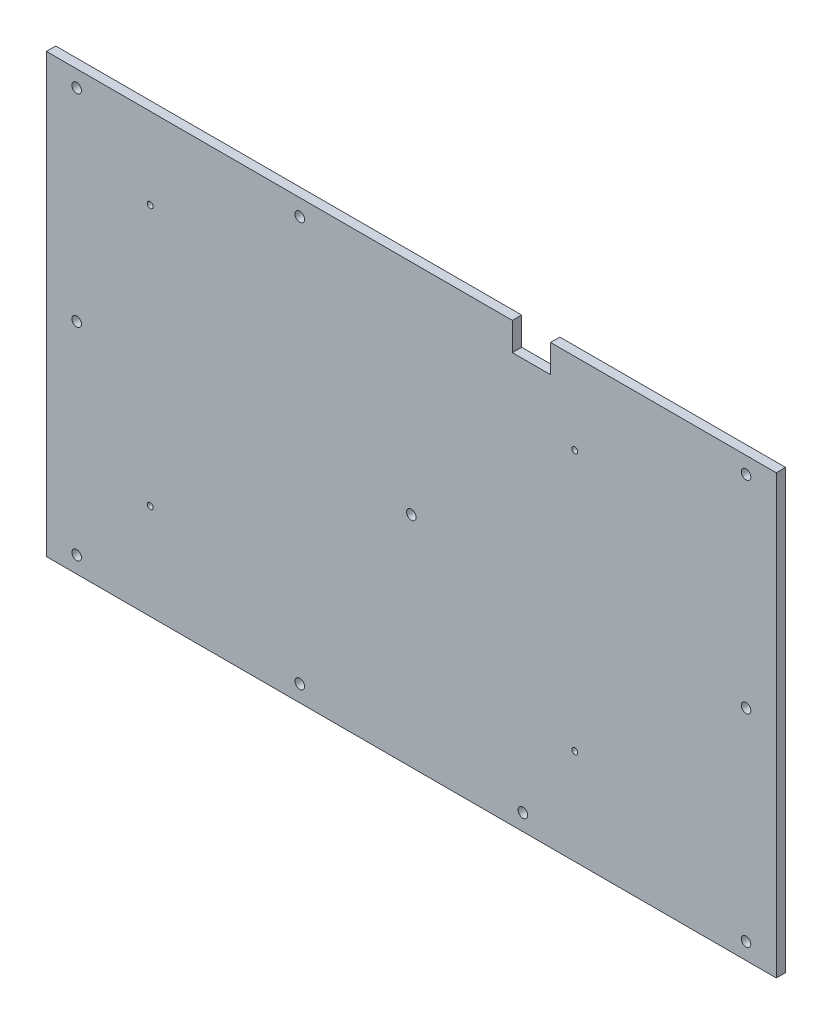
ISO-10303-21;
HEADER;
FILE_DESCRIPTION(('STEP AP214'),'2;1');
FILE_NAME('part.step','',(''),(''),'','','');
FILE_SCHEMA(('AUTOMOTIVE_DESIGN { 1 0 10303 214 1 1 1 1 }'));
ENDSEC;
DATA;
#1=APPLICATION_CONTEXT('core data for automotive mechanical design processes');
#2=APPLICATION_PROTOCOL_DEFINITION('international standard','automotive_design',2000,#1);
#3=PRODUCT_CONTEXT('',#1,'mechanical');
#4=PRODUCT('Part','Part','',(#3));
#5=PRODUCT_RELATED_PRODUCT_CATEGORY('part','',(#4));
#6=PRODUCT_DEFINITION_FORMATION('','',#4);
#7=PRODUCT_DEFINITION_CONTEXT('part definition',#1,'design');
#8=PRODUCT_DEFINITION('design','',#6,#7);
#9=PRODUCT_DEFINITION_SHAPE('','',#8);
#10=(LENGTH_UNIT() NAMED_UNIT(*) SI_UNIT(.MILLI.,.METRE.));
#11=(NAMED_UNIT(*) PLANE_ANGLE_UNIT() SI_UNIT($,.RADIAN.));
#12=(NAMED_UNIT(*) SI_UNIT($,.STERADIAN.) SOLID_ANGLE_UNIT());
#13=UNCERTAINTY_MEASURE_WITH_UNIT(LENGTH_MEASURE(1.E-05),#10,'distance_accuracy_value','');
#14=(GEOMETRIC_REPRESENTATION_CONTEXT(3) GLOBAL_UNCERTAINTY_ASSIGNED_CONTEXT((#13)) GLOBAL_UNIT_ASSIGNED_CONTEXT((#10,
#11,#12)) REPRESENTATION_CONTEXT('',''));
#15=CARTESIAN_POINT('',(0.,0.,0.));
#16=DIRECTION('',(0.,0.,1.));
#17=DIRECTION('',(1.,0.,0.));
#18=AXIS2_PLACEMENT_3D('',#15,#16,#17);
#19=CARTESIAN_POINT('',(0.,0.,0.));
#20=DIRECTION('',(0.,0.,1.));
#21=DIRECTION('',(1.,0.,0.));
#22=AXIS2_PLACEMENT_3D('',#19,#20,#21);
#23=PLANE('',#22);
#24=CARTESIAN_POINT('',(55.7276,-41.9735,0.));
#25=DIRECTION('',(0.,0.,-1.));
#26=DIRECTION('',(-1.,0.,0.));
#27=AXIS2_PLACEMENT_3D('',#24,#25,#26);
#28=CIRCLE('',#27,1.016);
#29=CARTESIAN_POINT('',(54.7116,-41.9735,0.));
#30=VERTEX_POINT('',#29);
#31=EDGE_CURVE('E258',#30,#30,#28,.T.);
#32=ORIENTED_EDGE('',*,*,#31,.F.);
#33=EDGE_LOOP('',(#32));
#34=FACE_BOUND('',#33,.T.);
#35=CARTESIAN_POINT('',(55.7276,46.9265,0.));
#36=DIRECTION('',(0.,0.,-1.));
#37=DIRECTION('',(-1.,0.,0.));
#38=AXIS2_PLACEMENT_3D('',#35,#36,#37);
#39=CIRCLE('',#38,1.016);
#40=CARTESIAN_POINT('',(54.7116,46.9265,0.));
#41=VERTEX_POINT('',#40);
#42=EDGE_CURVE('E252',#41,#41,#39,.T.);
#43=ORIENTED_EDGE('',*,*,#42,.F.);
#44=EDGE_LOOP('',(#43));
#45=FACE_BOUND('',#44,.T.);
#46=CARTESIAN_POINT('',(-89.0524,46.9265,0.));
#47=DIRECTION('',(0.,0.,-1.));
#48=DIRECTION('',(-1.,0.,0.));
#49=AXIS2_PLACEMENT_3D('',#46,#47,#48);
#50=CIRCLE('',#49,1.016);
#51=CARTESIAN_POINT('',(-90.0684,46.9265,0.));
#52=VERTEX_POINT('',#51);
#53=EDGE_CURVE('E246',#52,#52,#50,.T.);
#54=ORIENTED_EDGE('',*,*,#53,.F.);
#55=EDGE_LOOP('',(#54));
#56=FACE_BOUND('',#55,.T.);
#57=CARTESIAN_POINT('',(-89.0524,-41.9735,0.));
#58=DIRECTION('',(0.,0.,-1.));
#59=DIRECTION('',(-1.,0.,0.));
#60=AXIS2_PLACEMENT_3D('',#57,#58,#59);
#61=CIRCLE('',#60,1.016);
#62=CARTESIAN_POINT('',(-90.0684,-41.9735,0.));
#63=VERTEX_POINT('',#62);
#64=EDGE_CURVE('E240',#63,#63,#61,.T.);
#65=ORIENTED_EDGE('',*,*,#64,.F.);
#66=EDGE_LOOP('',(#65));
#67=FACE_BOUND('',#66,.T.);
#68=CARTESIAN_POINT('',(-114.1476,-68.9864,0.));
#69=DIRECTION('',(0.,0.,-1.));
#70=DIRECTION('',(-1.,0.,0.));
#71=AXIS2_PLACEMENT_3D('',#68,#69,#70);
#72=CIRCLE('',#71,1.63194999999999);
#73=CARTESIAN_POINT('',(-115.77955,-68.9864,0.));
#74=VERTEX_POINT('',#73);
#75=EDGE_CURVE('E234',#74,#74,#72,.T.);
#76=ORIENTED_EDGE('',*,*,#75,.F.);
#77=EDGE_LOOP('',(#76));
#78=FACE_BOUND('',#77,.T.);
#79=CARTESIAN_POINT('',(114.1476,-68.9864,0.));
#80=DIRECTION('',(0.,0.,-1.));
#81=DIRECTION('',(-1.,0.,0.));
#82=AXIS2_PLACEMENT_3D('',#79,#80,#81);
#83=CIRCLE('',#82,1.63194999999999);
#84=CARTESIAN_POINT('',(112.51565,-68.9864,0.));
#85=VERTEX_POINT('',#84);
#86=EDGE_CURVE('E228',#85,#85,#83,.T.);
#87=ORIENTED_EDGE('',*,*,#86,.F.);
#88=EDGE_LOOP('',(#87));
#89=FACE_BOUND('',#88,.T.);
#90=CARTESIAN_POINT('',(114.1476,68.9864,0.));
#91=DIRECTION('',(0.,0.,-1.));
#92=DIRECTION('',(-1.,0.,0.));
#93=AXIS2_PLACEMENT_3D('',#90,#91,#92);
#94=CIRCLE('',#93,1.63194999999999);
#95=CARTESIAN_POINT('',(112.51565,68.9864,0.));
#96=VERTEX_POINT('',#95);
#97=EDGE_CURVE('E225',#96,#96,#94,.T.);
#98=ORIENTED_EDGE('',*,*,#97,.F.);
#99=EDGE_LOOP('',(#98));
#100=FACE_BOUND('',#99,.T.);
#101=CARTESIAN_POINT('',(-114.1476,68.9864,0.));
#102=DIRECTION('',(0.,0.,-1.));
#103=DIRECTION('',(-1.,0.,0.));
#104=AXIS2_PLACEMENT_3D('',#101,#102,#103);
#105=CIRCLE('',#104,1.63194999999999);
#106=CARTESIAN_POINT('',(-115.77955,68.9864,0.));
#107=VERTEX_POINT('',#106);
#108=EDGE_CURVE('E219',#107,#107,#105,.T.);
#109=ORIENTED_EDGE('',*,*,#108,.F.);
#110=EDGE_LOOP('',(#109));
#111=FACE_BOUND('',#110,.T.);
#112=CARTESIAN_POINT('',(-114.1476,0.,0.));
#113=DIRECTION('',(0.,0.,-1.));
#114=DIRECTION('',(-1.,0.,0.));
#115=AXIS2_PLACEMENT_3D('',#112,#113,#114);
#116=CIRCLE('',#115,1.63194999999999);
#117=CARTESIAN_POINT('',(-115.77955,0.,0.));
#118=VERTEX_POINT('',#117);
#119=EDGE_CURVE('E213',#118,#118,#116,.T.);
#120=ORIENTED_EDGE('',*,*,#119,.F.);
#121=EDGE_LOOP('',(#120));
#122=FACE_BOUND('',#121,.T.);
#123=CARTESIAN_POINT('',(114.1476,0.,0.));
#124=DIRECTION('',(0.,0.,-1.));
#125=DIRECTION('',(-1.,0.,0.));
#126=AXIS2_PLACEMENT_3D('',#123,#124,#125);
#127=CIRCLE('',#126,1.63194999999999);
#128=CARTESIAN_POINT('',(112.51565,0.,0.));
#129=VERTEX_POINT('',#128);
#130=EDGE_CURVE('E207',#129,#129,#127,.T.);
#131=ORIENTED_EDGE('',*,*,#130,.F.);
#132=EDGE_LOOP('',(#131));
#133=FACE_BOUND('',#132,.T.);
#134=CARTESIAN_POINT('',(38.0492,-68.9864,0.));
#135=DIRECTION('',(0.,0.,-1.));
#136=DIRECTION('',(-1.,0.,0.));
#137=AXIS2_PLACEMENT_3D('',#134,#135,#136);
#138=CIRCLE('',#137,1.63194999999999);
#139=CARTESIAN_POINT('',(36.41725,-68.9864,0.));
#140=VERTEX_POINT('',#139);
#141=EDGE_CURVE('E195',#140,#140,#138,.T.);
#142=ORIENTED_EDGE('',*,*,#141,.F.);
#143=EDGE_LOOP('',(#142));
#144=FACE_BOUND('',#143,.T.);
#145=CARTESIAN_POINT('',(-38.0492,-68.9864,0.));
#146=DIRECTION('',(0.,0.,-1.));
#147=DIRECTION('',(-1.,0.,0.));
#148=AXIS2_PLACEMENT_3D('',#145,#146,#147);
#149=CIRCLE('',#148,1.63194999999999);
#150=CARTESIAN_POINT('',(-39.68115,-68.9864,0.));
#151=VERTEX_POINT('',#150);
#152=EDGE_CURVE('E189',#151,#151,#149,.T.);
#153=ORIENTED_EDGE('',*,*,#152,.F.);
#154=EDGE_LOOP('',(#153));
#155=FACE_BOUND('',#154,.T.);
#156=CARTESIAN_POINT('',(0.,0.,0.));
#157=DIRECTION('',(0.,0.,-1.));
#158=DIRECTION('',(-1.,0.,0.));
#159=AXIS2_PLACEMENT_3D('',#156,#157,#158);
#160=CIRCLE('',#159,1.63194999999999);
#161=CARTESIAN_POINT('',(-1.63194999999999,0.,0.));
#162=VERTEX_POINT('',#161);
#163=EDGE_CURVE('E183',#162,#162,#160,.T.);
#164=ORIENTED_EDGE('',*,*,#163,.F.);
#165=EDGE_LOOP('',(#164));
#166=FACE_BOUND('',#165,.T.);
#167=DIRECTION('',(0.,1.,0.));
#168=VECTOR('',#167,1.);
#169=CARTESIAN_POINT('',(47.4726000000003,0.,0.));
#170=LINE('',#169,#168);
#171=CARTESIAN_POINT('',(47.4726000000003,65.0875000000002,0.));
#172=VERTEX_POINT('',#171);
#173=CARTESIAN_POINT('',(47.4726000000003,74.6125000000002,0.));
#174=VERTEX_POINT('',#173);
#175=EDGE_CURVE('E132',#172,#174,#170,.T.);
#176=ORIENTED_EDGE('',*,*,#175,.T.);
#177=DIRECTION('',(1.,0.,0.));
#178=VECTOR('',#177,1.);
#179=CARTESIAN_POINT('',(0.,74.6125000000002,0.));
#180=LINE('',#179,#178);
#181=CARTESIAN_POINT('',(124.46,74.6125000000002,0.));
#182=VERTEX_POINT('',#181);
#183=EDGE_CURVE('E145',#174,#182,#180,.T.);
#184=ORIENTED_EDGE('',*,*,#183,.T.);
#185=DIRECTION('',(0.,-1.,0.));
#186=VECTOR('',#185,1.);
#187=CARTESIAN_POINT('',(124.46,1.11022302462516E-13,0.));
#188=LINE('',#187,#186);
#189=CARTESIAN_POINT('',(124.46,-74.6125,0.));
#190=VERTEX_POINT('',#189);
#191=EDGE_CURVE('E148',#182,#190,#188,.T.);
#192=ORIENTED_EDGE('',*,*,#191,.T.);
#193=DIRECTION('',(1.,0.,0.));
#194=VECTOR('',#193,1.);
#195=CARTESIAN_POINT('',(0.,-74.6125000000001,0.));
#196=LINE('',#195,#194);
#197=CARTESIAN_POINT('',(-124.46,-74.6125000000001,0.));
#198=VERTEX_POINT('',#197);
#199=EDGE_CURVE('E120',#198,#190,#196,.T.);
#200=ORIENTED_EDGE('',*,*,#199,.F.);
#201=DIRECTION('',(0.,-1.,0.));
#202=VECTOR('',#201,1.);
#203=CARTESIAN_POINT('',(-124.46,0.,0.));
#204=LINE('',#203,#202);
#205=CARTESIAN_POINT('',(-124.46,74.6125000000001,0.));
#206=VERTEX_POINT('',#205);
#207=EDGE_CURVE('E144',#206,#198,#204,.T.);
#208=ORIENTED_EDGE('',*,*,#207,.F.);
#209=CARTESIAN_POINT('',(34.4424000000002,74.6125000000002,0.));
#210=VERTEX_POINT('',#209);
#211=EDGE_CURVE('E141',#206,#210,#180,.T.);
#212=ORIENTED_EDGE('',*,*,#211,.T.);
#213=DIRECTION('',(0.,-1.,0.));
#214=VECTOR('',#213,1.);
#215=CARTESIAN_POINT('',(34.4424000000003,0.,0.));
#216=LINE('',#215,#214);
#217=CARTESIAN_POINT('',(34.4424000000002,65.0875000000002,0.));
#218=VERTEX_POINT('',#217);
#219=EDGE_CURVE('E138',#210,#218,#216,.T.);
#220=ORIENTED_EDGE('',*,*,#219,.T.);
#221=DIRECTION('',(1.,0.,0.));
#222=VECTOR('',#221,1.);
#223=CARTESIAN_POINT('',(0.,65.0875000000002,0.));
#224=LINE('',#223,#222);
#225=EDGE_CURVE('E134',#218,#172,#224,.T.);
#226=ORIENTED_EDGE('',*,*,#225,.T.);
#227=EDGE_LOOP('',(#176,#184,#192,#200,#208,#212,#220,#226));
#228=FACE_BOUND('',#227,.T.);
#229=CARTESIAN_POINT('',(-38.0492,68.9864,0.));
#230=DIRECTION('',(0.,0.,-1.));
#231=DIRECTION('',(-1.,0.,0.));
#232=AXIS2_PLACEMENT_3D('',#229,#230,#231);
#233=CIRCLE('',#232,1.63194999999999);
#234=CARTESIAN_POINT('',(-39.68115,68.9864,0.));
#235=VERTEX_POINT('',#234);
#236=EDGE_CURVE('E201',#235,#235,#233,.T.);
#237=ORIENTED_EDGE('',*,*,#236,.F.);
#238=EDGE_LOOP('',(#237));
#239=FACE_BOUND('',#238,.T.);
#240=ADVANCED_FACE('F35',(#34,#45,#56,#67,#78,#89,#100,#111,#122,#133,#144,#155,#166,#228,#239),
#23,.F.);
#241=CARTESIAN_POINT('',(47.4726000000003,0.,3.175));
#242=DIRECTION('',(-1.,0.,0.));
#243=DIRECTION('',(0.,-1.,0.));
#244=AXIS2_PLACEMENT_3D('',#241,#242,#243);
#245=PLANE('',#244);
#246=ORIENTED_EDGE('',*,*,#175,.F.);
#247=DIRECTION('',(0.,0.,-1.));
#248=VECTOR('',#247,1.);
#249=CARTESIAN_POINT('',(47.4726000000003,65.0875000000002,3.175));
#250=LINE('',#249,#248);
#251=CARTESIAN_POINT('',(47.4726000000003,65.0875000000002,3.175));
#252=VERTEX_POINT('',#251);
#253=EDGE_CURVE('E11',#252,#172,#250,.T.);
#254=ORIENTED_EDGE('',*,*,#253,.F.);
#255=DIRECTION('',(0.,1.,0.));
#256=VECTOR('',#255,1.);
#257=CARTESIAN_POINT('',(47.4726000000003,0.,3.175));
#258=LINE('',#257,#256);
#259=CARTESIAN_POINT('',(47.4726000000003,74.6125000000002,3.175));
#260=VERTEX_POINT('',#259);
#261=EDGE_CURVE('E177',#252,#260,#258,.T.);
#262=ORIENTED_EDGE('',*,*,#261,.T.);
#263=DIRECTION('',(0.,0.,-1.));
#264=VECTOR('',#263,1.);
#265=CARTESIAN_POINT('',(47.4726000000003,74.6125000000002,3.175));
#266=LINE('',#265,#264);
#267=EDGE_CURVE('E53',#260,#174,#266,.T.);
#268=ORIENTED_EDGE('',*,*,#267,.T.);
#269=EDGE_LOOP('',(#246,#254,#262,#268));
#270=FACE_BOUND('',#269,.T.);
#271=ADVANCED_FACE('F37',(#270),#245,.T.);
#272=CARTESIAN_POINT('',(0.,65.0875000000002,3.175));
#273=DIRECTION('',(0.,1.,0.));
#274=DIRECTION('',(-1.,0.,0.));
#275=AXIS2_PLACEMENT_3D('',#272,#273,#274);
#276=PLANE('',#275);
#277=ORIENTED_EDGE('',*,*,#225,.F.);
#278=DIRECTION('',(0.,0.,-1.));
#279=VECTOR('',#278,1.);
#280=CARTESIAN_POINT('',(34.4424000000002,65.0875000000002,3.175));
#281=LINE('',#280,#279);
#282=CARTESIAN_POINT('',(34.4424000000002,65.0875000000002,3.175));
#283=VERTEX_POINT('',#282);
#284=EDGE_CURVE('E45',#283,#218,#281,.T.);
#285=ORIENTED_EDGE('',*,*,#284,.F.);
#286=DIRECTION('',(1.,0.,0.));
#287=VECTOR('',#286,1.);
#288=CARTESIAN_POINT('',(0.,65.0875000000002,3.175));
#289=LINE('',#288,#287);
#290=EDGE_CURVE('E175',#283,#252,#289,.T.);
#291=ORIENTED_EDGE('',*,*,#290,.T.);
#292=ORIENTED_EDGE('',*,*,#253,.T.);
#293=EDGE_LOOP('',(#277,#285,#291,#292));
#294=FACE_BOUND('',#293,.T.);
#295=ADVANCED_FACE('F167',(#294),#276,.T.);
#296=CARTESIAN_POINT('',(34.4424000000003,0.,3.175));
#297=DIRECTION('',(1.,0.,0.));
#298=DIRECTION('',(0.,1.,0.));
#299=AXIS2_PLACEMENT_3D('',#296,#297,#298);
#300=PLANE('',#299);
#301=ORIENTED_EDGE('',*,*,#219,.F.);
#302=DIRECTION('',(0.,0.,-1.));
#303=VECTOR('',#302,1.);
#304=CARTESIAN_POINT('',(34.4424000000002,74.6125000000002,3.175));
#305=LINE('',#304,#303);
#306=CARTESIAN_POINT('',(34.4424000000002,74.6125000000002,3.175));
#307=VERTEX_POINT('',#306);
#308=EDGE_CURVE('E155',#307,#210,#305,.T.);
#309=ORIENTED_EDGE('',*,*,#308,.F.);
#310=DIRECTION('',(0.,-1.,0.));
#311=VECTOR('',#310,1.);
#312=CARTESIAN_POINT('',(34.4424000000003,0.,3.175));
#313=LINE('',#312,#311);
#314=EDGE_CURVE('E163',#307,#283,#313,.T.);
#315=ORIENTED_EDGE('',*,*,#314,.T.);
#316=ORIENTED_EDGE('',*,*,#284,.T.);
#317=EDGE_LOOP('',(#301,#309,#315,#316));
#318=FACE_BOUND('',#317,.T.);
#319=ADVANCED_FACE('F161',(#318),#300,.T.);
#320=CARTESIAN_POINT('',(0.,74.6125000000002,3.175));
#321=DIRECTION('',(0.,1.,0.));
#322=DIRECTION('',(-1.,0.,0.));
#323=AXIS2_PLACEMENT_3D('',#320,#321,#322);
#324=PLANE('',#323);
#325=ORIENTED_EDGE('',*,*,#211,.F.);
#326=DIRECTION('',(0.,0.,-1.));
#327=VECTOR('',#326,1.);
#328=CARTESIAN_POINT('',(-124.46,74.6125000000001,3.175));
#329=LINE('',#328,#327);
#330=CARTESIAN_POINT('',(-124.46,74.6125000000001,3.175));
#331=VERTEX_POINT('',#330);
#332=EDGE_CURVE('E153',#331,#206,#329,.T.);
#333=ORIENTED_EDGE('',*,*,#332,.F.);
#334=DIRECTION('',(1.,0.,0.));
#335=VECTOR('',#334,1.);
#336=CARTESIAN_POINT('',(0.,74.6125000000002,3.175));
#337=LINE('',#336,#335);
#338=EDGE_CURVE('E129',#331,#307,#337,.T.);
#339=ORIENTED_EDGE('',*,*,#338,.T.);
#340=ORIENTED_EDGE('',*,*,#308,.T.);
#341=EDGE_LOOP('',(#325,#333,#339,#340));
#342=FACE_BOUND('',#341,.T.);
#343=ADVANCED_FACE('F173',(#342),#324,.T.);
#344=CARTESIAN_POINT('',(-124.46,0.,3.175));
#345=DIRECTION('',(1.,0.,0.));
#346=DIRECTION('',(0.,1.,0.));
#347=AXIS2_PLACEMENT_3D('',#344,#345,#346);
#348=PLANE('',#347);
#349=ORIENTED_EDGE('',*,*,#207,.T.);
#350=DIRECTION('',(0.,0.,-1.));
#351=VECTOR('',#350,1.);
#352=CARTESIAN_POINT('',(-124.46,-74.6125000000001,3.175));
#353=LINE('',#352,#351);
#354=CARTESIAN_POINT('',(-124.46,-74.6125000000001,3.175));
#355=VERTEX_POINT('',#354);
#356=EDGE_CURVE('E123',#355,#198,#353,.T.);
#357=ORIENTED_EDGE('',*,*,#356,.F.);
#358=DIRECTION('',(0.,-1.,0.));
#359=VECTOR('',#358,1.);
#360=CARTESIAN_POINT('',(-124.46,0.,3.175));
#361=LINE('',#360,#359);
#362=EDGE_CURVE('E111',#331,#355,#361,.T.);
#363=ORIENTED_EDGE('',*,*,#362,.F.);
#364=ORIENTED_EDGE('',*,*,#332,.T.);
#365=EDGE_LOOP('',(#349,#357,#363,#364));
#366=FACE_BOUND('',#365,.T.);
#367=ADVANCED_FACE('F314',(#366),#348,.F.);
#368=CARTESIAN_POINT('',(0.,-74.6125000000001,3.175));
#369=DIRECTION('',(0.,1.,0.));
#370=DIRECTION('',(-1.,0.,0.));
#371=AXIS2_PLACEMENT_3D('',#368,#369,#370);
#372=PLANE('',#371);
#373=ORIENTED_EDGE('',*,*,#199,.T.);
#374=DIRECTION('',(0.,0.,-1.));
#375=VECTOR('',#374,1.);
#376=CARTESIAN_POINT('',(124.46,-74.6125,3.175));
#377=LINE('',#376,#375);
#378=CARTESIAN_POINT('',(124.46,-74.6125,3.175));
#379=VERTEX_POINT('',#378);
#380=EDGE_CURVE('E117',#379,#190,#377,.T.);
#381=ORIENTED_EDGE('',*,*,#380,.F.);
#382=DIRECTION('',(1.,0.,0.));
#383=VECTOR('',#382,1.);
#384=CARTESIAN_POINT('',(0.,-74.6125000000001,3.175));
#385=LINE('',#384,#383);
#386=EDGE_CURVE('E103',#355,#379,#385,.T.);
#387=ORIENTED_EDGE('',*,*,#386,.F.);
#388=ORIENTED_EDGE('',*,*,#356,.T.);
#389=EDGE_LOOP('',(#373,#381,#387,#388));
#390=FACE_BOUND('',#389,.T.);
#391=ADVANCED_FACE('F118',(#390),#372,.F.);
#392=CARTESIAN_POINT('',(124.46,1.11022302462516E-13,3.175));
#393=DIRECTION('',(1.,0.,0.));
#394=DIRECTION('',(0.,1.,0.));
#395=AXIS2_PLACEMENT_3D('',#392,#393,#394);
#396=PLANE('',#395);
#397=ORIENTED_EDGE('',*,*,#191,.F.);
#398=DIRECTION('',(0.,0.,-1.));
#399=VECTOR('',#398,1.);
#400=CARTESIAN_POINT('',(124.46,74.6125000000002,3.175));
#401=LINE('',#400,#399);
#402=CARTESIAN_POINT('',(124.46,74.6125000000002,3.175));
#403=VERTEX_POINT('',#402);
#404=EDGE_CURVE('E78',#403,#182,#401,.T.);
#405=ORIENTED_EDGE('',*,*,#404,.F.);
#406=DIRECTION('',(0.,-1.,0.));
#407=VECTOR('',#406,1.);
#408=CARTESIAN_POINT('',(124.46,1.11022302462516E-13,3.175));
#409=LINE('',#408,#407);
#410=EDGE_CURVE('E108',#403,#379,#409,.T.);
#411=ORIENTED_EDGE('',*,*,#410,.T.);
#412=ORIENTED_EDGE('',*,*,#380,.T.);
#413=EDGE_LOOP('',(#397,#405,#411,#412));
#414=FACE_BOUND('',#413,.T.);
#415=ADVANCED_FACE('F125',(#414),#396,.T.);
#416=ORIENTED_EDGE('',*,*,#183,.F.);
#417=ORIENTED_EDGE('',*,*,#267,.F.);
#418=EDGE_CURVE('E126',#260,#403,#337,.T.);
#419=ORIENTED_EDGE('',*,*,#418,.T.);
#420=ORIENTED_EDGE('',*,*,#404,.T.);
#421=EDGE_LOOP('',(#416,#417,#419,#420));
#422=FACE_BOUND('',#421,.T.);
#423=ADVANCED_FACE('F303',(#422),#324,.T.);
#424=CARTESIAN_POINT('',(0.,0.,3.175));
#425=DIRECTION('',(0.,0.,1.));
#426=DIRECTION('',(1.,0.,0.));
#427=AXIS2_PLACEMENT_3D('',#424,#425,#426);
#428=PLANE('',#427);
#429=CARTESIAN_POINT('',(55.7276,-41.9735,3.175));
#430=DIRECTION('',(0.,0.,1.));
#431=DIRECTION('',(1.,0.,0.));
#432=AXIS2_PLACEMENT_3D('',#429,#430,#431);
#433=CIRCLE('',#432,1.016);
#434=CARTESIAN_POINT('',(56.7436,-41.9735,3.175));
#435=VERTEX_POINT('',#434);
#436=EDGE_CURVE('E255',#435,#435,#433,.T.);
#437=ORIENTED_EDGE('',*,*,#436,.F.);
#438=EDGE_LOOP('',(#437));
#439=FACE_BOUND('',#438,.T.);
#440=CARTESIAN_POINT('',(55.7276,46.9265,3.175));
#441=DIRECTION('',(0.,0.,1.));
#442=DIRECTION('',(1.,0.,0.));
#443=AXIS2_PLACEMENT_3D('',#440,#441,#442);
#444=CIRCLE('',#443,1.016);
#445=CARTESIAN_POINT('',(56.7436,46.9265,3.175));
#446=VERTEX_POINT('',#445);
#447=EDGE_CURVE('E249',#446,#446,#444,.T.);
#448=ORIENTED_EDGE('',*,*,#447,.F.);
#449=EDGE_LOOP('',(#448));
#450=FACE_BOUND('',#449,.T.);
#451=CARTESIAN_POINT('',(-89.0524,46.9265,3.175));
#452=DIRECTION('',(0.,0.,1.));
#453=DIRECTION('',(1.,0.,0.));
#454=AXIS2_PLACEMENT_3D('',#451,#452,#453);
#455=CIRCLE('',#454,1.016);
#456=CARTESIAN_POINT('',(-88.0364,46.9265,3.175));
#457=VERTEX_POINT('',#456);
#458=EDGE_CURVE('E243',#457,#457,#455,.T.);
#459=ORIENTED_EDGE('',*,*,#458,.F.);
#460=EDGE_LOOP('',(#459));
#461=FACE_BOUND('',#460,.T.);
#462=CARTESIAN_POINT('',(-89.0524,-41.9735,3.175));
#463=DIRECTION('',(0.,0.,1.));
#464=DIRECTION('',(1.,0.,0.));
#465=AXIS2_PLACEMENT_3D('',#462,#463,#464);
#466=CIRCLE('',#465,1.016);
#467=CARTESIAN_POINT('',(-88.0364,-41.9735,3.175));
#468=VERTEX_POINT('',#467);
#469=EDGE_CURVE('E237',#468,#468,#466,.T.);
#470=ORIENTED_EDGE('',*,*,#469,.F.);
#471=EDGE_LOOP('',(#470));
#472=FACE_BOUND('',#471,.T.);
#473=CARTESIAN_POINT('',(-114.1476,-68.9864,3.175));
#474=DIRECTION('',(0.,0.,1.));
#475=DIRECTION('',(1.,0.,0.));
#476=AXIS2_PLACEMENT_3D('',#473,#474,#475);
#477=CIRCLE('',#476,1.63194999999999);
#478=CARTESIAN_POINT('',(-112.51565,-68.9864,3.175));
#479=VERTEX_POINT('',#478);
#480=EDGE_CURVE('E231',#479,#479,#477,.T.);
#481=ORIENTED_EDGE('',*,*,#480,.F.);
#482=EDGE_LOOP('',(#481));
#483=FACE_BOUND('',#482,.T.);
#484=CARTESIAN_POINT('',(114.1476,-68.9864,3.175));
#485=DIRECTION('',(0.,0.,1.));
#486=DIRECTION('',(1.,0.,0.));
#487=AXIS2_PLACEMENT_3D('',#484,#485,#486);
#488=CIRCLE('',#487,1.63194999999999);
#489=CARTESIAN_POINT('',(115.77955,-68.9864,3.175));
#490=VERTEX_POINT('',#489);
#491=EDGE_CURVE('E39',#490,#490,#488,.T.);
#492=ORIENTED_EDGE('',*,*,#491,.F.);
#493=EDGE_LOOP('',(#492));
#494=FACE_BOUND('',#493,.T.);
#495=CARTESIAN_POINT('',(114.1476,68.9864,3.175));
#496=DIRECTION('',(0.,0.,1.));
#497=DIRECTION('',(1.,0.,0.));
#498=AXIS2_PLACEMENT_3D('',#495,#496,#497);
#499=CIRCLE('',#498,1.63194999999999);
#500=CARTESIAN_POINT('',(115.77955,68.9864,3.175));
#501=VERTEX_POINT('',#500);
#502=EDGE_CURVE('E222',#501,#501,#499,.T.);
#503=ORIENTED_EDGE('',*,*,#502,.F.);
#504=EDGE_LOOP('',(#503));
#505=FACE_BOUND('',#504,.T.);
#506=CARTESIAN_POINT('',(-114.1476,68.9864,3.175));
#507=DIRECTION('',(0.,0.,1.));
#508=DIRECTION('',(1.,0.,0.));
#509=AXIS2_PLACEMENT_3D('',#506,#507,#508);
#510=CIRCLE('',#509,1.63194999999999);
#511=CARTESIAN_POINT('',(-112.51565,68.9864,3.175));
#512=VERTEX_POINT('',#511);
#513=EDGE_CURVE('E216',#512,#512,#510,.T.);
#514=ORIENTED_EDGE('',*,*,#513,.F.);
#515=EDGE_LOOP('',(#514));
#516=FACE_BOUND('',#515,.T.);
#517=CARTESIAN_POINT('',(-114.1476,0.,3.175));
#518=DIRECTION('',(0.,0.,1.));
#519=DIRECTION('',(1.,0.,0.));
#520=AXIS2_PLACEMENT_3D('',#517,#518,#519);
#521=CIRCLE('',#520,1.63194999999999);
#522=CARTESIAN_POINT('',(-112.51565,0.,3.175));
#523=VERTEX_POINT('',#522);
#524=EDGE_CURVE('E210',#523,#523,#521,.T.);
#525=ORIENTED_EDGE('',*,*,#524,.F.);
#526=EDGE_LOOP('',(#525));
#527=FACE_BOUND('',#526,.T.);
#528=CARTESIAN_POINT('',(114.1476,0.,3.175));
#529=DIRECTION('',(0.,0.,1.));
#530=DIRECTION('',(1.,0.,0.));
#531=AXIS2_PLACEMENT_3D('',#528,#529,#530);
#532=CIRCLE('',#531,1.63194999999999);
#533=CARTESIAN_POINT('',(115.77955,0.,3.175));
#534=VERTEX_POINT('',#533);
#535=EDGE_CURVE('E204',#534,#534,#532,.T.);
#536=ORIENTED_EDGE('',*,*,#535,.F.);
#537=EDGE_LOOP('',(#536));
#538=FACE_BOUND('',#537,.T.);
#539=CARTESIAN_POINT('',(-38.0492,68.9864,3.175));
#540=DIRECTION('',(0.,0.,1.));
#541=DIRECTION('',(1.,0.,0.));
#542=AXIS2_PLACEMENT_3D('',#539,#540,#541);
#543=CIRCLE('',#542,1.63194999999999);
#544=CARTESIAN_POINT('',(-36.41725,68.9864,3.175));
#545=VERTEX_POINT('',#544);
#546=EDGE_CURVE('E198',#545,#545,#543,.T.);
#547=ORIENTED_EDGE('',*,*,#546,.F.);
#548=EDGE_LOOP('',(#547));
#549=FACE_BOUND('',#548,.T.);
#550=CARTESIAN_POINT('',(38.0492,-68.9864,3.175));
#551=DIRECTION('',(0.,0.,1.));
#552=DIRECTION('',(1.,0.,0.));
#553=AXIS2_PLACEMENT_3D('',#550,#551,#552);
#554=CIRCLE('',#553,1.63194999999999);
#555=CARTESIAN_POINT('',(39.68115,-68.9864,3.175));
#556=VERTEX_POINT('',#555);
#557=EDGE_CURVE('E192',#556,#556,#554,.T.);
#558=ORIENTED_EDGE('',*,*,#557,.F.);
#559=EDGE_LOOP('',(#558));
#560=FACE_BOUND('',#559,.T.);
#561=CARTESIAN_POINT('',(-38.0492,-68.9864,3.175));
#562=DIRECTION('',(0.,0.,1.));
#563=DIRECTION('',(1.,0.,0.));
#564=AXIS2_PLACEMENT_3D('',#561,#562,#563);
#565=CIRCLE('',#564,1.63194999999999);
#566=CARTESIAN_POINT('',(-36.41725,-68.9864,3.175));
#567=VERTEX_POINT('',#566);
#568=EDGE_CURVE('E186',#567,#567,#565,.T.);
#569=ORIENTED_EDGE('',*,*,#568,.F.);
#570=EDGE_LOOP('',(#569));
#571=FACE_BOUND('',#570,.T.);
#572=CARTESIAN_POINT('',(0.,0.,3.175));
#573=DIRECTION('',(0.,0.,1.));
#574=DIRECTION('',(1.,0.,0.));
#575=AXIS2_PLACEMENT_3D('',#572,#573,#574);
#576=CIRCLE('',#575,1.63194999999999);
#577=CARTESIAN_POINT('',(1.63194999999999,0.,3.175));
#578=VERTEX_POINT('',#577);
#579=EDGE_CURVE('E135',#578,#578,#576,.T.);
#580=ORIENTED_EDGE('',*,*,#579,.F.);
#581=EDGE_LOOP('',(#580));
#582=FACE_BOUND('',#581,.T.);
#583=ORIENTED_EDGE('',*,*,#261,.F.);
#584=ORIENTED_EDGE('',*,*,#290,.F.);
#585=ORIENTED_EDGE('',*,*,#314,.F.);
#586=ORIENTED_EDGE('',*,*,#338,.F.);
#587=ORIENTED_EDGE('',*,*,#362,.T.);
#588=ORIENTED_EDGE('',*,*,#386,.T.);
#589=ORIENTED_EDGE('',*,*,#410,.F.);
#590=ORIENTED_EDGE('',*,*,#418,.F.);
#591=EDGE_LOOP('',(#583,#584,#585,#586,#587,#588,#589,#590));
#592=FACE_BOUND('',#591,.T.);
#593=ADVANCED_FACE('F105',(#439,#450,#461,#472,#483,#494,#505,#516,#527,#538,#549,#560,#571,
#582,#592),#428,.T.);
#594=CARTESIAN_POINT('',(0.,0.,0.));
#595=DIRECTION('',(0.,0.,-1.));
#596=DIRECTION('',(-1.,0.,0.));
#597=AXIS2_PLACEMENT_3D('',#594,#595,#596);
#598=CYLINDRICAL_SURFACE('',#597,1.63194999999999);
#599=ORIENTED_EDGE('',*,*,#579,.T.);
#600=EDGE_LOOP('',(#599));
#601=FACE_BOUND('',#600,.T.);
#602=ORIENTED_EDGE('',*,*,#163,.T.);
#603=EDGE_LOOP('',(#602));
#604=FACE_BOUND('',#603,.T.);
#605=ADVANCED_FACE('F291',(#601,#604),#598,.F.);
#606=CARTESIAN_POINT('',(-38.0492,-68.9864,0.));
#607=DIRECTION('',(0.,0.,-1.));
#608=DIRECTION('',(-1.,0.,0.));
#609=AXIS2_PLACEMENT_3D('',#606,#607,#608);
#610=CYLINDRICAL_SURFACE('',#609,1.63194999999999);
#611=ORIENTED_EDGE('',*,*,#568,.T.);
#612=EDGE_LOOP('',(#611));
#613=FACE_BOUND('',#612,.T.);
#614=ORIENTED_EDGE('',*,*,#152,.T.);
#615=EDGE_LOOP('',(#614));
#616=FACE_BOUND('',#615,.T.);
#617=ADVANCED_FACE('F293',(#613,#616),#610,.F.);
#618=CARTESIAN_POINT('',(38.0492,-68.9864,0.));
#619=DIRECTION('',(0.,0.,-1.));
#620=DIRECTION('',(-1.,0.,0.));
#621=AXIS2_PLACEMENT_3D('',#618,#619,#620);
#622=CYLINDRICAL_SURFACE('',#621,1.63194999999999);
#623=ORIENTED_EDGE('',*,*,#557,.T.);
#624=EDGE_LOOP('',(#623));
#625=FACE_BOUND('',#624,.T.);
#626=ORIENTED_EDGE('',*,*,#141,.T.);
#627=EDGE_LOOP('',(#626));
#628=FACE_BOUND('',#627,.T.);
#629=ADVANCED_FACE('F300',(#625,#628),#622,.F.);
#630=CARTESIAN_POINT('',(-38.0492,68.9864,0.));
#631=DIRECTION('',(0.,0.,-1.));
#632=DIRECTION('',(-1.,0.,0.));
#633=AXIS2_PLACEMENT_3D('',#630,#631,#632);
#634=CYLINDRICAL_SURFACE('',#633,1.63194999999999);
#635=ORIENTED_EDGE('',*,*,#546,.T.);
#636=EDGE_LOOP('',(#635));
#637=FACE_BOUND('',#636,.T.);
#638=ORIENTED_EDGE('',*,*,#236,.T.);
#639=EDGE_LOOP('',(#638));
#640=FACE_BOUND('',#639,.T.);
#641=ADVANCED_FACE('F434',(#637,#640),#634,.F.);
#642=CARTESIAN_POINT('',(114.1476,0.,0.));
#643=DIRECTION('',(0.,0.,-1.));
#644=DIRECTION('',(-1.,0.,0.));
#645=AXIS2_PLACEMENT_3D('',#642,#643,#644);
#646=CYLINDRICAL_SURFACE('',#645,1.63194999999999);
#647=ORIENTED_EDGE('',*,*,#535,.T.);
#648=EDGE_LOOP('',(#647));
#649=FACE_BOUND('',#648,.T.);
#650=ORIENTED_EDGE('',*,*,#130,.T.);
#651=EDGE_LOOP('',(#650));
#652=FACE_BOUND('',#651,.T.);
#653=ADVANCED_FACE('F426',(#649,#652),#646,.F.);
#654=CARTESIAN_POINT('',(-114.1476,0.,0.));
#655=DIRECTION('',(0.,0.,-1.));
#656=DIRECTION('',(-1.,0.,0.));
#657=AXIS2_PLACEMENT_3D('',#654,#655,#656);
#658=CYLINDRICAL_SURFACE('',#657,1.63194999999999);
#659=ORIENTED_EDGE('',*,*,#524,.T.);
#660=EDGE_LOOP('',(#659));
#661=FACE_BOUND('',#660,.T.);
#662=ORIENTED_EDGE('',*,*,#119,.T.);
#663=EDGE_LOOP('',(#662));
#664=FACE_BOUND('',#663,.T.);
#665=ADVANCED_FACE('F418',(#661,#664),#658,.F.);
#666=CARTESIAN_POINT('',(-114.1476,68.9864,0.));
#667=DIRECTION('',(0.,0.,-1.));
#668=DIRECTION('',(-1.,0.,0.));
#669=AXIS2_PLACEMENT_3D('',#666,#667,#668);
#670=CYLINDRICAL_SURFACE('',#669,1.63194999999999);
#671=ORIENTED_EDGE('',*,*,#513,.T.);
#672=EDGE_LOOP('',(#671));
#673=FACE_BOUND('',#672,.T.);
#674=ORIENTED_EDGE('',*,*,#108,.T.);
#675=EDGE_LOOP('',(#674));
#676=FACE_BOUND('',#675,.T.);
#677=ADVANCED_FACE('F410',(#673,#676),#670,.F.);
#678=CARTESIAN_POINT('',(114.1476,68.9864,0.));
#679=DIRECTION('',(0.,0.,-1.));
#680=DIRECTION('',(-1.,0.,0.));
#681=AXIS2_PLACEMENT_3D('',#678,#679,#680);
#682=CYLINDRICAL_SURFACE('',#681,1.63194999999999);
#683=ORIENTED_EDGE('',*,*,#502,.T.);
#684=EDGE_LOOP('',(#683));
#685=FACE_BOUND('',#684,.T.);
#686=ORIENTED_EDGE('',*,*,#97,.T.);
#687=EDGE_LOOP('',(#686));
#688=FACE_BOUND('',#687,.T.);
#689=ADVANCED_FACE('F402',(#685,#688),#682,.F.);
#690=CARTESIAN_POINT('',(114.1476,-68.9864,0.));
#691=DIRECTION('',(0.,0.,-1.));
#692=DIRECTION('',(-1.,0.,0.));
#693=AXIS2_PLACEMENT_3D('',#690,#691,#692);
#694=CYLINDRICAL_SURFACE('',#693,1.63194999999999);
#695=ORIENTED_EDGE('',*,*,#491,.T.);
#696=EDGE_LOOP('',(#695));
#697=FACE_BOUND('',#696,.T.);
#698=ORIENTED_EDGE('',*,*,#86,.T.);
#699=EDGE_LOOP('',(#698));
#700=FACE_BOUND('',#699,.T.);
#701=ADVANCED_FACE('F397',(#697,#700),#694,.F.);
#702=CARTESIAN_POINT('',(-114.1476,-68.9864,0.));
#703=DIRECTION('',(0.,0.,-1.));
#704=DIRECTION('',(-1.,0.,0.));
#705=AXIS2_PLACEMENT_3D('',#702,#703,#704);
#706=CYLINDRICAL_SURFACE('',#705,1.63194999999999);
#707=ORIENTED_EDGE('',*,*,#480,.T.);
#708=EDGE_LOOP('',(#707));
#709=FACE_BOUND('',#708,.T.);
#710=ORIENTED_EDGE('',*,*,#75,.T.);
#711=EDGE_LOOP('',(#710));
#712=FACE_BOUND('',#711,.T.);
#713=ADVANCED_FACE('F338',(#709,#712),#706,.F.);
#714=CARTESIAN_POINT('',(-89.0524,-41.9735,0.));
#715=DIRECTION('',(0.,0.,-1.));
#716=DIRECTION('',(-1.,0.,0.));
#717=AXIS2_PLACEMENT_3D('',#714,#715,#716);
#718=CYLINDRICAL_SURFACE('',#717,1.016);
#719=ORIENTED_EDGE('',*,*,#469,.T.);
#720=EDGE_LOOP('',(#719));
#721=FACE_BOUND('',#720,.T.);
#722=ORIENTED_EDGE('',*,*,#64,.T.);
#723=EDGE_LOOP('',(#722));
#724=FACE_BOUND('',#723,.T.);
#725=ADVANCED_FACE('F349',(#721,#724),#718,.F.);
#726=CARTESIAN_POINT('',(-89.0524,46.9265,0.));
#727=DIRECTION('',(0.,0.,-1.));
#728=DIRECTION('',(-1.,0.,0.));
#729=AXIS2_PLACEMENT_3D('',#726,#727,#728);
#730=CYLINDRICAL_SURFACE('',#729,1.016);
#731=ORIENTED_EDGE('',*,*,#458,.T.);
#732=EDGE_LOOP('',(#731));
#733=FACE_BOUND('',#732,.T.);
#734=ORIENTED_EDGE('',*,*,#53,.T.);
#735=EDGE_LOOP('',(#734));
#736=FACE_BOUND('',#735,.T.);
#737=ADVANCED_FACE('F355',(#733,#736),#730,.F.);
#738=CARTESIAN_POINT('',(55.7276,46.9265,0.));
#739=DIRECTION('',(0.,0.,-1.));
#740=DIRECTION('',(-1.,0.,0.));
#741=AXIS2_PLACEMENT_3D('',#738,#739,#740);
#742=CYLINDRICAL_SURFACE('',#741,1.016);
#743=ORIENTED_EDGE('',*,*,#447,.T.);
#744=EDGE_LOOP('',(#743));
#745=FACE_BOUND('',#744,.T.);
#746=ORIENTED_EDGE('',*,*,#42,.T.);
#747=EDGE_LOOP('',(#746));
#748=FACE_BOUND('',#747,.T.);
#749=ADVANCED_FACE('F366',(#745,#748),#742,.F.);
#750=CARTESIAN_POINT('',(55.7276,-41.9735,0.));
#751=DIRECTION('',(0.,0.,-1.));
#752=DIRECTION('',(-1.,0.,0.));
#753=AXIS2_PLACEMENT_3D('',#750,#751,#752);
#754=CYLINDRICAL_SURFACE('',#753,1.016);
#755=ORIENTED_EDGE('',*,*,#436,.T.);
#756=EDGE_LOOP('',(#755));
#757=FACE_BOUND('',#756,.T.);
#758=ORIENTED_EDGE('',*,*,#31,.T.);
#759=EDGE_LOOP('',(#758));
#760=FACE_BOUND('',#759,.T.);
#761=ADVANCED_FACE('F262',(#757,#760),#754,.F.);
#762=CLOSED_SHELL('',(#240,#271,#295,#319,#343,#367,#391,#415,#423,#593,#605,#617,#629,#641,
#653,#665,#677,#689,#701,#713,#725,#737,#749,#761));
#763=MANIFOLD_SOLID_BREP('B2',#762);
#764=ADVANCED_BREP_SHAPE_REPRESENTATION('',(#18,#763),#14);
#765=SHAPE_DEFINITION_REPRESENTATION(#9,#764);
ENDSEC;
END-ISO-10303-21;
